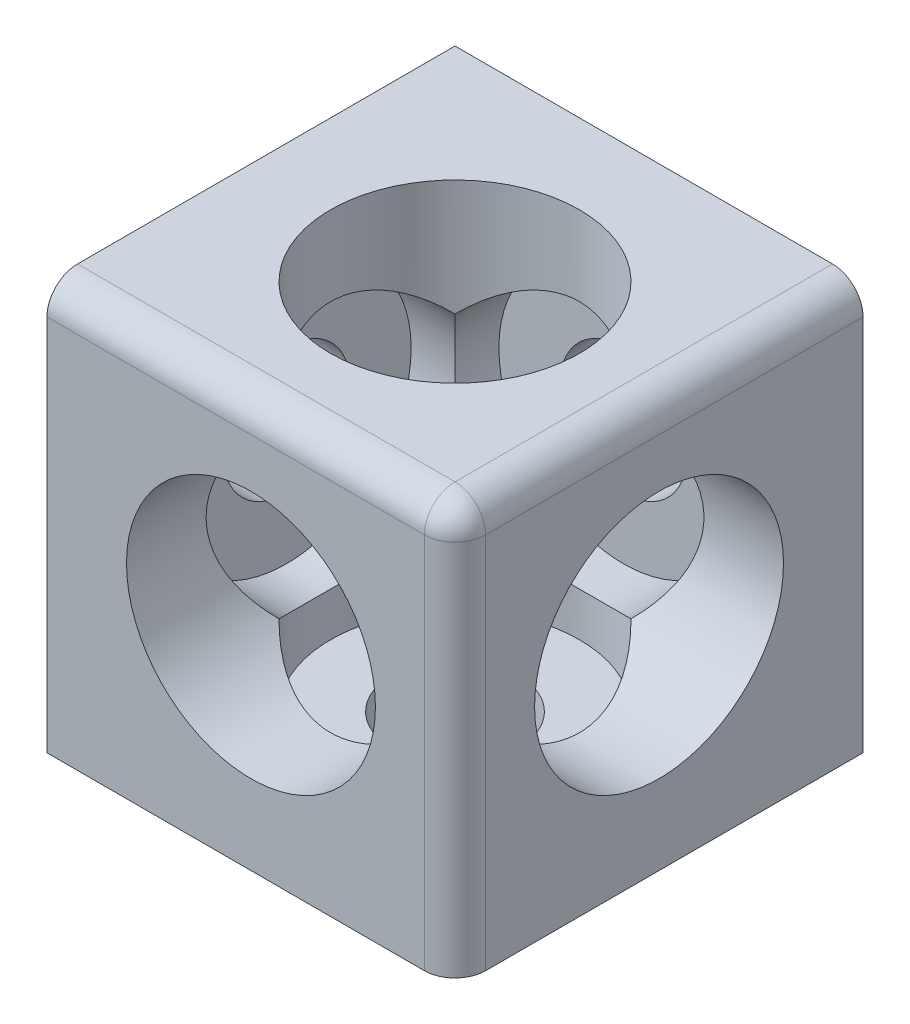
ISO-10303-21;
HEADER;
FILE_DESCRIPTION(('STEP AP214'),'2;1');
FILE_NAME('part.step','',(''),(''),'','','');
FILE_SCHEMA(('AUTOMOTIVE_DESIGN { 1 0 10303 214 1 1 1 1 }'));
ENDSEC;
DATA;
#1=APPLICATION_CONTEXT('core data for automotive mechanical design processes');
#2=APPLICATION_PROTOCOL_DEFINITION('international standard','automotive_design',2000,#1);
#3=PRODUCT_CONTEXT('',#1,'mechanical');
#4=PRODUCT('Part','Part','',(#3));
#5=PRODUCT_RELATED_PRODUCT_CATEGORY('part','',(#4));
#6=PRODUCT_DEFINITION_FORMATION('','',#4);
#7=PRODUCT_DEFINITION_CONTEXT('part definition',#1,'design');
#8=PRODUCT_DEFINITION('design','',#6,#7);
#9=PRODUCT_DEFINITION_SHAPE('','',#8);
#10=(LENGTH_UNIT() NAMED_UNIT(*) SI_UNIT(.MILLI.,.METRE.));
#11=(NAMED_UNIT(*) PLANE_ANGLE_UNIT() SI_UNIT($,.RADIAN.));
#12=(NAMED_UNIT(*) SI_UNIT($,.STERADIAN.) SOLID_ANGLE_UNIT());
#13=UNCERTAINTY_MEASURE_WITH_UNIT(LENGTH_MEASURE(1.E-05),#10,'distance_accuracy_value','');
#14=(GEOMETRIC_REPRESENTATION_CONTEXT(3) GLOBAL_UNCERTAINTY_ASSIGNED_CONTEXT((#13)) GLOBAL_UNIT_ASSIGNED_CONTEXT((#10,
#11,#12)) REPRESENTATION_CONTEXT('',''));
#15=CARTESIAN_POINT('',(0.,0.,0.));
#16=DIRECTION('',(0.,0.,1.));
#17=DIRECTION('',(1.,0.,0.));
#18=AXIS2_PLACEMENT_3D('',#15,#16,#17);
#19=CARTESIAN_POINT('',(20.,0.,1.75));
#20=DIRECTION('',(0.,0.,-1.));
#21=DIRECTION('',(-1.,0.,0.));
#22=AXIS2_PLACEMENT_3D('',#19,#20,#21);
#23=CYLINDRICAL_SURFACE('',#22,12.2);
#24=CARTESIAN_POINT('',(20.,0.,-16.5));
#25=DIRECTION('',(0.,0.,-1.));
#26=DIRECTION('',(-1.,0.,0.));
#27=AXIS2_PLACEMENT_3D('',#24,#25,#26);
#28=CIRCLE('',#27,12.2);
#29=CARTESIAN_POINT('',(7.80000000000001,0.,-16.5));
#30=VERTEX_POINT('',#29);
#31=EDGE_CURVE('E20',#30,#30,#28,.T.);
#32=ORIENTED_EDGE('',*,*,#31,.T.);
#33=EDGE_LOOP('',(#32));
#34=FACE_BOUND('',#33,.T.);
#35=CARTESIAN_POINT('',(20.,0.,0.));
#36=DIRECTION('',(0.,0.707106781186547,-0.707106781186548));
#37=DIRECTION('',(0.,-0.707106781186548,-0.707106781186547));
#38=AXIS2_PLACEMENT_3D('',#35,#36,#37);
#39=ELLIPSE('',#38,17.2534054609518,12.2);
#40=CARTESIAN_POINT('',(11.3732972695241,-8.62670273047588,-8.62670273047588));
#41=VERTEX_POINT('',#40);
#42=CARTESIAN_POINT('',(28.6267027304759,-8.62670273047588,-8.62670273047588));
#43=VERTEX_POINT('',#42);
#44=EDGE_CURVE('E107',#41,#43,#39,.F.);
#45=ORIENTED_EDGE('',*,*,#44,.T.);
#46=CARTESIAN_POINT('',(20.,0.,0.));
#47=DIRECTION('',(-0.707106781186547,0.,-0.707106781186548));
#48=DIRECTION('',(0.707106781186548,0.,-0.707106781186547));
#49=AXIS2_PLACEMENT_3D('',#46,#47,#48);
#50=ELLIPSE('',#49,17.2534054609518,12.2);
#51=CARTESIAN_POINT('',(28.6267027304759,8.62670273047588,-8.62670273047588));
#52=VERTEX_POINT('',#51);
#53=EDGE_CURVE('E89',#43,#52,#50,.F.);
#54=ORIENTED_EDGE('',*,*,#53,.T.);
#55=CARTESIAN_POINT('',(20.,0.,0.));
#56=DIRECTION('',(0.,-0.707106781186548,-0.707106781186547));
#57=DIRECTION('',(0.,0.707106781186547,-0.707106781186548));
#58=AXIS2_PLACEMENT_3D('',#55,#56,#57);
#59=ELLIPSE('',#58,17.2534054609518,12.2);
#60=CARTESIAN_POINT('',(11.3732972695241,8.62670273047588,-8.62670273047588));
#61=VERTEX_POINT('',#60);
#62=EDGE_CURVE('E100',#52,#61,#59,.F.);
#63=ORIENTED_EDGE('',*,*,#62,.T.);
#64=CARTESIAN_POINT('',(20.,0.,0.));
#65=DIRECTION('',(0.707106781186548,0.,-0.707106781186547));
#66=DIRECTION('',(-0.707106781186547,0.,-0.707106781186548));
#67=AXIS2_PLACEMENT_3D('',#64,#65,#66);
#68=ELLIPSE('',#67,17.2534054609518,12.2);
#69=EDGE_CURVE('E117',#61,#41,#68,.F.);
#70=ORIENTED_EDGE('',*,*,#69,.T.);
#71=EDGE_LOOP('',(#45,#54,#63,#70));
#72=FACE_BOUND('',#71,.T.);
#73=ADVANCED_FACE('F16',(#34,#72),#23,.F.);
#74=CARTESIAN_POINT('',(20.,0.,-16.5));
#75=DIRECTION('',(0.,0.,-1.));
#76=DIRECTION('',(-1.,0.,0.));
#77=AXIS2_PLACEMENT_3D('',#74,#75,#76);
#78=PLANE('',#77);
#79=CARTESIAN_POINT('',(20.,0.,-16.5));
#80=DIRECTION('',(0.,0.,1.));
#81=DIRECTION('',(1.,0.,0.));
#82=AXIS2_PLACEMENT_3D('',#79,#80,#81);
#83=CIRCLE('',#82,6.2);
#84=CARTESIAN_POINT('',(26.2,0.,-16.5));
#85=VERTEX_POINT('',#84);
#86=EDGE_CURVE('E96',#85,#85,#83,.F.);
#87=ORIENTED_EDGE('',*,*,#86,.T.);
#88=EDGE_LOOP('',(#87));
#89=FACE_BOUND('',#88,.T.);
#90=ORIENTED_EDGE('',*,*,#31,.F.);
#91=EDGE_LOOP('',(#90));
#92=FACE_BOUND('',#91,.T.);
#93=ADVANCED_FACE('F264',(#89,#92),#78,.F.);
#94=CARTESIAN_POINT('',(3.5,0.,0.));
#95=DIRECTION('',(-1.,0.,0.));
#96=DIRECTION('',(0.,0.,1.));
#97=AXIS2_PLACEMENT_3D('',#94,#95,#96);
#98=PLANE('',#97);
#99=CARTESIAN_POINT('',(3.5,0.,0.));
#100=DIRECTION('',(1.,0.,0.));
#101=DIRECTION('',(0.,0.,-1.));
#102=AXIS2_PLACEMENT_3D('',#99,#100,#101);
#103=CIRCLE('',#102,6.2);
#104=CARTESIAN_POINT('',(3.5,0.,-6.2));
#105=VERTEX_POINT('',#104);
#106=EDGE_CURVE('E212',#105,#105,#103,.F.);
#107=ORIENTED_EDGE('',*,*,#106,.T.);
#108=EDGE_LOOP('',(#107));
#109=FACE_BOUND('',#108,.T.);
#110=CARTESIAN_POINT('',(3.5,0.,0.));
#111=DIRECTION('',(-1.,0.,0.));
#112=DIRECTION('',(0.,0.,1.));
#113=AXIS2_PLACEMENT_3D('',#110,#111,#112);
#114=CIRCLE('',#113,12.2);
#115=CARTESIAN_POINT('',(3.5,0.,12.2));
#116=VERTEX_POINT('',#115);
#117=EDGE_CURVE('E119',#116,#116,#114,.F.);
#118=ORIENTED_EDGE('',*,*,#117,.T.);
#119=EDGE_LOOP('',(#118));
#120=FACE_BOUND('',#119,.T.);
#121=ADVANCED_FACE('F124',(#109,#120),#98,.F.);
#122=CARTESIAN_POINT('',(20.,1.75,0.));
#123=DIRECTION('',(0.,-1.,0.));
#124=DIRECTION('',(0.,0.,-1.));
#125=AXIS2_PLACEMENT_3D('',#122,#123,#124);
#126=CYLINDRICAL_SURFACE('',#125,12.2);
#127=CARTESIAN_POINT('',(20.,0.,0.));
#128=DIRECTION('',(0.,-0.707106781186547,0.707106781186548));
#129=DIRECTION('',(0.,-0.707106781186548,-0.707106781186547));
#130=AXIS2_PLACEMENT_3D('',#127,#128,#129);
#131=ELLIPSE('',#130,17.2534054609518,12.2);
#132=CARTESIAN_POINT('',(28.6267027304759,8.62670273047587,8.62670273047588));
#133=VERTEX_POINT('',#132);
#134=CARTESIAN_POINT('',(11.3732972695241,8.62670273047588,8.62670273047587));
#135=VERTEX_POINT('',#134);
#136=EDGE_CURVE('E256',#133,#135,#131,.T.);
#137=ORIENTED_EDGE('',*,*,#136,.T.);
#138=CARTESIAN_POINT('',(20.,0.,0.));
#139=DIRECTION('',(-0.707106781186547,-0.707106781186547,0.));
#140=DIRECTION('',(0.707106781186547,-0.707106781186547,0.));
#141=AXIS2_PLACEMENT_3D('',#138,#139,#140);
#142=ELLIPSE('',#141,17.2534054609518,12.2);
#143=EDGE_CURVE('E103',#135,#61,#142,.T.);
#144=ORIENTED_EDGE('',*,*,#143,.T.);
#145=ORIENTED_EDGE('',*,*,#62,.F.);
#146=CARTESIAN_POINT('',(20.,0.,0.));
#147=DIRECTION('',(0.707106781186547,-0.707106781186547,0.));
#148=DIRECTION('',(-0.707106781186547,-0.707106781186547,0.));
#149=AXIS2_PLACEMENT_3D('',#146,#147,#148);
#150=ELLIPSE('',#149,17.2534054609518,12.2);
#151=EDGE_CURVE('E84',#52,#133,#150,.T.);
#152=ORIENTED_EDGE('',*,*,#151,.T.);
#153=EDGE_LOOP('',(#137,#144,#145,#152));
#154=FACE_BOUND('',#153,.T.);
#155=CARTESIAN_POINT('',(20.,20.,0.));
#156=DIRECTION('',(0.,-1.,0.));
#157=DIRECTION('',(0.,0.,-1.));
#158=AXIS2_PLACEMENT_3D('',#155,#156,#157);
#159=CIRCLE('',#158,12.2);
#160=CARTESIAN_POINT('',(20.,20.,-12.2));
#161=VERTEX_POINT('',#160);
#162=EDGE_CURVE('E213',#161,#161,#159,.F.);
#163=ORIENTED_EDGE('',*,*,#162,.T.);
#164=EDGE_LOOP('',(#163));
#165=FACE_BOUND('',#164,.T.);
#166=ADVANCED_FACE('F101',(#154,#165),#126,.F.);
#167=CARTESIAN_POINT('',(21.75,0.,0.));
#168=DIRECTION('',(-1.,0.,0.));
#169=DIRECTION('',(0.,0.,1.));
#170=AXIS2_PLACEMENT_3D('',#167,#168,#169);
#171=CYLINDRICAL_SURFACE('',#170,12.2);
#172=ORIENTED_EDGE('',*,*,#69,.F.);
#173=ORIENTED_EDGE('',*,*,#143,.F.);
#174=CARTESIAN_POINT('',(20.,0.,0.));
#175=DIRECTION('',(-0.707106781186547,0.,-0.707106781186548));
#176=DIRECTION('',(-0.707106781186548,0.,0.707106781186547));
#177=AXIS2_PLACEMENT_3D('',#174,#175,#176);
#178=ELLIPSE('',#177,17.2534054609518,12.2);
#179=CARTESIAN_POINT('',(11.3732972695241,-8.62670273047588,8.62670273047588));
#180=VERTEX_POINT('',#179);
#181=EDGE_CURVE('E253',#135,#180,#178,.F.);
#182=ORIENTED_EDGE('',*,*,#181,.T.);
#183=CARTESIAN_POINT('',(20.,0.,0.));
#184=DIRECTION('',(-0.707106781186547,0.707106781186547,0.));
#185=DIRECTION('',(-0.707106781186547,-0.707106781186547,0.));
#186=AXIS2_PLACEMENT_3D('',#183,#184,#185);
#187=ELLIPSE('',#186,17.2534054609518,12.2);
#188=EDGE_CURVE('E111',#180,#41,#187,.F.);
#189=ORIENTED_EDGE('',*,*,#188,.T.);
#190=EDGE_LOOP('',(#172,#173,#182,#189));
#191=FACE_BOUND('',#190,.T.);
#192=ORIENTED_EDGE('',*,*,#117,.F.);
#193=EDGE_LOOP('',(#192));
#194=FACE_BOUND('',#193,.T.);
#195=ADVANCED_FACE('F126',(#191,#194),#171,.F.);
#196=CARTESIAN_POINT('',(20.,1.75,0.));
#197=DIRECTION('',(0.,-1.,0.));
#198=DIRECTION('',(0.,0.,-1.));
#199=AXIS2_PLACEMENT_3D('',#196,#197,#198);
#200=CYLINDRICAL_SURFACE('',#199,12.2);
#201=CARTESIAN_POINT('',(20.,-16.5,0.));
#202=DIRECTION('',(0.,-1.,0.));
#203=DIRECTION('',(0.,0.,-1.));
#204=AXIS2_PLACEMENT_3D('',#201,#202,#203);
#205=CIRCLE('',#204,12.2);
#206=CARTESIAN_POINT('',(20.,-16.5,-12.2));
#207=VERTEX_POINT('',#206);
#208=EDGE_CURVE('E217',#207,#207,#205,.T.);
#209=ORIENTED_EDGE('',*,*,#208,.T.);
#210=EDGE_LOOP('',(#209));
#211=FACE_BOUND('',#210,.T.);
#212=ORIENTED_EDGE('',*,*,#44,.F.);
#213=ORIENTED_EDGE('',*,*,#188,.F.);
#214=CARTESIAN_POINT('',(20.,0.,0.));
#215=DIRECTION('',(0.,-0.707106781186548,-0.707106781186547));
#216=DIRECTION('',(0.,-0.707106781186547,0.707106781186548));
#217=AXIS2_PLACEMENT_3D('',#214,#215,#216);
#218=ELLIPSE('',#217,17.2534054609518,12.2);
#219=CARTESIAN_POINT('',(28.6267027304759,-8.62670273047587,8.62670273047588));
#220=VERTEX_POINT('',#219);
#221=EDGE_CURVE('E250',#180,#220,#218,.F.);
#222=ORIENTED_EDGE('',*,*,#221,.T.);
#223=CARTESIAN_POINT('',(20.,0.,0.));
#224=DIRECTION('',(-0.707106781186547,-0.707106781186547,0.));
#225=DIRECTION('',(0.707106781186547,-0.707106781186547,0.));
#226=AXIS2_PLACEMENT_3D('',#223,#224,#225);
#227=ELLIPSE('',#226,17.2534054609518,12.2);
#228=EDGE_CURVE('E109',#220,#43,#227,.F.);
#229=ORIENTED_EDGE('',*,*,#228,.T.);
#230=EDGE_LOOP('',(#212,#213,#222,#229));
#231=FACE_BOUND('',#230,.T.);
#232=ADVANCED_FACE('F128',(#211,#231),#200,.F.);
#233=CARTESIAN_POINT('',(21.75,0.,0.));
#234=DIRECTION('',(-1.,0.,0.));
#235=DIRECTION('',(0.,0.,1.));
#236=AXIS2_PLACEMENT_3D('',#233,#234,#235);
#237=CYLINDRICAL_SURFACE('',#236,12.2);
#238=ORIENTED_EDGE('',*,*,#53,.F.);
#239=ORIENTED_EDGE('',*,*,#228,.F.);
#240=CARTESIAN_POINT('',(20.,0.,0.));
#241=DIRECTION('',(-0.707106781186548,0.,0.707106781186547));
#242=DIRECTION('',(-0.707106781186547,0.,-0.707106781186548));
#243=AXIS2_PLACEMENT_3D('',#240,#241,#242);
#244=ELLIPSE('',#243,17.2534054609518,12.2);
#245=EDGE_CURVE('E92',#220,#133,#244,.T.);
#246=ORIENTED_EDGE('',*,*,#245,.T.);
#247=ORIENTED_EDGE('',*,*,#151,.F.);
#248=EDGE_LOOP('',(#238,#239,#246,#247));
#249=FACE_BOUND('',#248,.T.);
#250=CARTESIAN_POINT('',(40.,0.,0.));
#251=DIRECTION('',(-1.,0.,0.));
#252=DIRECTION('',(0.,0.,1.));
#253=AXIS2_PLACEMENT_3D('',#250,#251,#252);
#254=CIRCLE('',#253,12.2);
#255=CARTESIAN_POINT('',(40.,0.,12.2));
#256=VERTEX_POINT('',#255);
#257=EDGE_CURVE('E187',#256,#256,#254,.F.);
#258=ORIENTED_EDGE('',*,*,#257,.T.);
#259=EDGE_LOOP('',(#258));
#260=FACE_BOUND('',#259,.T.);
#261=ADVANCED_FACE('F86',(#249,#260),#237,.F.);
#262=CARTESIAN_POINT('',(37.,17.,0.));
#263=DIRECTION('',(0.,0.,-1.));
#264=DIRECTION('',(0.,1.,0.));
#265=AXIS2_PLACEMENT_3D('',#262,#263,#264);
#266=CYLINDRICAL_SURFACE('',#265,3.);
#267=DIRECTION('',(0.,0.,1.));
#268=VECTOR('',#267,1.);
#269=CARTESIAN_POINT('',(40.,17.,0.));
#270=LINE('',#269,#268);
#271=CARTESIAN_POINT('',(40.,17.,17.));
#272=VERTEX_POINT('',#271);
#273=CARTESIAN_POINT('',(40.,17.,-20.));
#274=VERTEX_POINT('',#273);
#275=EDGE_CURVE('E188',#272,#274,#270,.F.);
#276=ORIENTED_EDGE('',*,*,#275,.T.);
#277=CARTESIAN_POINT('',(37.,17.,-20.));
#278=DIRECTION('',(0.,0.,-1.));
#279=DIRECTION('',(0.,1.,0.));
#280=AXIS2_PLACEMENT_3D('',#277,#278,#279);
#281=CIRCLE('',#280,3.);
#282=CARTESIAN_POINT('',(37.,20.,-20.));
#283=VERTEX_POINT('',#282);
#284=EDGE_CURVE('E241',#274,#283,#281,.F.);
#285=ORIENTED_EDGE('',*,*,#284,.T.);
#286=DIRECTION('',(0.,0.,-1.));
#287=VECTOR('',#286,1.);
#288=CARTESIAN_POINT('',(37.,20.,0.));
#289=LINE('',#288,#287);
#290=CARTESIAN_POINT('',(37.,20.,17.));
#291=VERTEX_POINT('',#290);
#292=EDGE_CURVE('E220',#283,#291,#289,.F.);
#293=ORIENTED_EDGE('',*,*,#292,.T.);
#294=CARTESIAN_POINT('',(37.,17.,17.));
#295=DIRECTION('',(0.,0.,1.));
#296=DIRECTION('',(1.,0.,0.));
#297=AXIS2_PLACEMENT_3D('',#294,#295,#296);
#298=CIRCLE('',#297,3.);
#299=EDGE_CURVE('E207',#272,#291,#298,.T.);
#300=ORIENTED_EDGE('',*,*,#299,.F.);
#301=EDGE_LOOP('',(#276,#285,#293,#300));
#302=FACE_BOUND('',#301,.T.);
#303=ADVANCED_FACE('F271',(#302),#266,.T.);
#304=CARTESIAN_POINT('',(20.,0.,-17.5));
#305=DIRECTION('',(0.,0.,1.));
#306=DIRECTION('',(1.,0.,0.));
#307=AXIS2_PLACEMENT_3D('',#304,#305,#306);
#308=CYLINDRICAL_SURFACE('',#307,6.2);
#309=ORIENTED_EDGE('',*,*,#86,.F.);
#310=EDGE_LOOP('',(#309));
#311=FACE_BOUND('',#310,.T.);
#312=CARTESIAN_POINT('',(20.,0.,-20.));
#313=DIRECTION('',(0.,0.,1.));
#314=DIRECTION('',(1.,0.,0.));
#315=AXIS2_PLACEMENT_3D('',#312,#313,#314);
#316=CIRCLE('',#315,6.2);
#317=CARTESIAN_POINT('',(26.2,0.,-20.));
#318=VERTEX_POINT('',#317);
#319=EDGE_CURVE('E179',#318,#318,#316,.F.);
#320=ORIENTED_EDGE('',*,*,#319,.T.);
#321=EDGE_LOOP('',(#320));
#322=FACE_BOUND('',#321,.T.);
#323=ADVANCED_FACE('F267',(#311,#322),#308,.F.);
#324=CARTESIAN_POINT('',(20.,20.,0.));
#325=DIRECTION('',(0.,-1.,0.));
#326=DIRECTION('',(0.,0.,-1.));
#327=AXIS2_PLACEMENT_3D('',#324,#325,#326);
#328=PLANE('',#327);
#329=ORIENTED_EDGE('',*,*,#162,.F.);
#330=EDGE_LOOP('',(#329));
#331=FACE_BOUND('',#330,.T.);
#332=ORIENTED_EDGE('',*,*,#292,.F.);
#333=DIRECTION('',(1.,0.,0.));
#334=VECTOR('',#333,1.);
#335=CARTESIAN_POINT('',(20.,20.,-20.));
#336=LINE('',#335,#334);
#337=CARTESIAN_POINT('',(0.,20.,-20.));
#338=VERTEX_POINT('',#337);
#339=EDGE_CURVE('E246',#283,#338,#336,.F.);
#340=ORIENTED_EDGE('',*,*,#339,.T.);
#341=DIRECTION('',(0.,0.,-1.));
#342=VECTOR('',#341,1.);
#343=CARTESIAN_POINT('',(0.,20.,0.));
#344=LINE('',#343,#342);
#345=CARTESIAN_POINT('',(0.,20.,17.));
#346=VERTEX_POINT('',#345);
#347=EDGE_CURVE('E178',#338,#346,#344,.F.);
#348=ORIENTED_EDGE('',*,*,#347,.T.);
#349=DIRECTION('',(-1.,0.,0.));
#350=VECTOR('',#349,1.);
#351=CARTESIAN_POINT('',(20.,20.,17.));
#352=LINE('',#351,#350);
#353=EDGE_CURVE('E210',#291,#346,#352,.T.);
#354=ORIENTED_EDGE('',*,*,#353,.F.);
#355=EDGE_LOOP('',(#332,#340,#348,#354));
#356=FACE_BOUND('',#355,.T.);
#357=ADVANCED_FACE('F270',(#331,#356),#328,.F.);
#358=CARTESIAN_POINT('',(2.5,0.,0.));
#359=DIRECTION('',(1.,0.,0.));
#360=DIRECTION('',(0.,0.,-1.));
#361=AXIS2_PLACEMENT_3D('',#358,#359,#360);
#362=CYLINDRICAL_SURFACE('',#361,6.2);
#363=ORIENTED_EDGE('',*,*,#106,.F.);
#364=EDGE_LOOP('',(#363));
#365=FACE_BOUND('',#364,.T.);
#366=CARTESIAN_POINT('',(0.,0.,0.));
#367=DIRECTION('',(1.,0.,0.));
#368=DIRECTION('',(0.,0.,-1.));
#369=AXIS2_PLACEMENT_3D('',#366,#367,#368);
#370=CIRCLE('',#369,6.2);
#371=CARTESIAN_POINT('',(0.,0.,-6.2));
#372=VERTEX_POINT('',#371);
#373=EDGE_CURVE('E194',#372,#372,#370,.F.);
#374=ORIENTED_EDGE('',*,*,#373,.T.);
#375=EDGE_LOOP('',(#374));
#376=FACE_BOUND('',#375,.T.);
#377=ADVANCED_FACE('F357',(#365,#376),#362,.F.);
#378=CARTESIAN_POINT('',(20.,17.,17.));
#379=DIRECTION('',(-1.,0.,0.));
#380=DIRECTION('',(0.,0.,1.));
#381=AXIS2_PLACEMENT_3D('',#378,#379,#380);
#382=CYLINDRICAL_SURFACE('',#381,3.);
#383=DIRECTION('',(1.,0.,0.));
#384=VECTOR('',#383,1.);
#385=CARTESIAN_POINT('',(20.,17.,20.));
#386=LINE('',#385,#384);
#387=CARTESIAN_POINT('',(37.,17.,20.));
#388=VERTEX_POINT('',#387);
#389=CARTESIAN_POINT('',(0.,17.,20.));
#390=VERTEX_POINT('',#389);
#391=EDGE_CURVE('E191',#388,#390,#386,.F.);
#392=ORIENTED_EDGE('',*,*,#391,.F.);
#393=CARTESIAN_POINT('',(37.,17.,17.));
#394=DIRECTION('',(1.,0.,0.));
#395=DIRECTION('',(0.,1.,0.));
#396=AXIS2_PLACEMENT_3D('',#393,#394,#395);
#397=CIRCLE('',#396,3.);
#398=EDGE_CURVE('E204',#291,#388,#397,.T.);
#399=ORIENTED_EDGE('',*,*,#398,.F.);
#400=ORIENTED_EDGE('',*,*,#353,.T.);
#401=CARTESIAN_POINT('',(0.,17.,17.));
#402=DIRECTION('',(-1.,0.,0.));
#403=DIRECTION('',(0.,0.,1.));
#404=AXIS2_PLACEMENT_3D('',#401,#402,#403);
#405=CIRCLE('',#404,3.);
#406=EDGE_CURVE('E237',#346,#390,#405,.F.);
#407=ORIENTED_EDGE('',*,*,#406,.T.);
#408=EDGE_LOOP('',(#392,#399,#400,#407));
#409=FACE_BOUND('',#408,.T.);
#410=ADVANCED_FACE('F301',(#409),#382,.T.);
#411=CARTESIAN_POINT('',(20.,0.,1.75));
#412=DIRECTION('',(0.,0.,-1.));
#413=DIRECTION('',(-1.,0.,0.));
#414=AXIS2_PLACEMENT_3D('',#411,#412,#413);
#415=CYLINDRICAL_SURFACE('',#414,12.2);
#416=CARTESIAN_POINT('',(20.,0.,20.));
#417=DIRECTION('',(0.,0.,-1.));
#418=DIRECTION('',(-1.,0.,0.));
#419=AXIS2_PLACEMENT_3D('',#416,#417,#418);
#420=CIRCLE('',#419,12.2);
#421=CARTESIAN_POINT('',(7.8,0.,20.));
#422=VERTEX_POINT('',#421);
#423=EDGE_CURVE('E201',#422,#422,#420,.T.);
#424=ORIENTED_EDGE('',*,*,#423,.F.);
#425=EDGE_LOOP('',(#424));
#426=FACE_BOUND('',#425,.T.);
#427=ORIENTED_EDGE('',*,*,#136,.F.);
#428=ORIENTED_EDGE('',*,*,#245,.F.);
#429=ORIENTED_EDGE('',*,*,#221,.F.);
#430=ORIENTED_EDGE('',*,*,#181,.F.);
#431=EDGE_LOOP('',(#427,#428,#429,#430));
#432=FACE_BOUND('',#431,.T.);
#433=ADVANCED_FACE('F329',(#426,#432),#415,.F.);
#434=CARTESIAN_POINT('',(37.,17.,17.));
#435=DIRECTION('',(1.,0.,0.));
#436=DIRECTION('',(0.,1.,0.));
#437=AXIS2_PLACEMENT_3D('',#434,#435,#436);
#438=SPHERICAL_SURFACE('',#437,3.);
#439=CARTESIAN_POINT('',(37.,17.,17.));
#440=DIRECTION('',(0.,1.,0.));
#441=DIRECTION('',(0.,0.,1.));
#442=AXIS2_PLACEMENT_3D('',#439,#440,#441);
#443=CIRCLE('',#442,3.);
#444=EDGE_CURVE('E197',#272,#388,#443,.F.);
#445=ORIENTED_EDGE('',*,*,#444,.F.);
#446=ORIENTED_EDGE('',*,*,#299,.T.);
#447=ORIENTED_EDGE('',*,*,#398,.T.);
#448=EDGE_LOOP('',(#445,#446,#447));
#449=FACE_BOUND('',#448,.T.);
#450=ADVANCED_FACE('F324',(#449),#438,.T.);
#451=CARTESIAN_POINT('',(20.,-16.5,0.));
#452=DIRECTION('',(0.,-1.,0.));
#453=DIRECTION('',(0.,0.,-1.));
#454=AXIS2_PLACEMENT_3D('',#451,#452,#453);
#455=PLANE('',#454);
#456=CARTESIAN_POINT('',(20.,-16.5,0.));
#457=DIRECTION('',(0.,1.,0.));
#458=DIRECTION('',(0.,0.,1.));
#459=AXIS2_PLACEMENT_3D('',#456,#457,#458);
#460=CIRCLE('',#459,6.2);
#461=CARTESIAN_POINT('',(20.,-16.5,6.2));
#462=VERTEX_POINT('',#461);
#463=EDGE_CURVE('E230',#462,#462,#460,.F.);
#464=ORIENTED_EDGE('',*,*,#463,.T.);
#465=EDGE_LOOP('',(#464));
#466=FACE_BOUND('',#465,.T.);
#467=ORIENTED_EDGE('',*,*,#208,.F.);
#468=EDGE_LOOP('',(#467));
#469=FACE_BOUND('',#468,.T.);
#470=ADVANCED_FACE('F328',(#466,#469),#455,.F.);
#471=CARTESIAN_POINT('',(40.,0.,0.));
#472=DIRECTION('',(-1.,0.,0.));
#473=DIRECTION('',(0.,0.,1.));
#474=AXIS2_PLACEMENT_3D('',#471,#472,#473);
#475=PLANE('',#474);
#476=ORIENTED_EDGE('',*,*,#257,.F.);
#477=EDGE_LOOP('',(#476));
#478=FACE_BOUND('',#477,.T.);
#479=DIRECTION('',(0.,0.,1.));
#480=VECTOR('',#479,1.);
#481=CARTESIAN_POINT('',(40.,-20.,0.));
#482=LINE('',#481,#480);
#483=CARTESIAN_POINT('',(40.,-20.,17.));
#484=VERTEX_POINT('',#483);
#485=CARTESIAN_POINT('',(40.,-20.,-20.));
#486=VERTEX_POINT('',#485);
#487=EDGE_CURVE('E169',#484,#486,#482,.F.);
#488=ORIENTED_EDGE('',*,*,#487,.T.);
#489=DIRECTION('',(0.,1.,0.));
#490=VECTOR('',#489,1.);
#491=CARTESIAN_POINT('',(40.,0.,-20.));
#492=LINE('',#491,#490);
#493=EDGE_CURVE('E243',#486,#274,#492,.T.);
#494=ORIENTED_EDGE('',*,*,#493,.T.);
#495=ORIENTED_EDGE('',*,*,#275,.F.);
#496=DIRECTION('',(0.,1.,0.));
#497=VECTOR('',#496,1.);
#498=CARTESIAN_POINT('',(40.,0.,17.));
#499=LINE('',#498,#497);
#500=EDGE_CURVE('E184',#484,#272,#499,.T.);
#501=ORIENTED_EDGE('',*,*,#500,.F.);
#502=EDGE_LOOP('',(#488,#494,#495,#501));
#503=FACE_BOUND('',#502,.T.);
#504=ADVANCED_FACE('F278',(#478,#503),#475,.F.);
#505=CARTESIAN_POINT('',(20.,0.,-20.));
#506=DIRECTION('',(0.,0.,1.));
#507=DIRECTION('',(1.,0.,0.));
#508=AXIS2_PLACEMENT_3D('',#505,#506,#507);
#509=PLANE('',#508);
#510=ORIENTED_EDGE('',*,*,#319,.F.);
#511=EDGE_LOOP('',(#510));
#512=FACE_BOUND('',#511,.T.);
#513=ORIENTED_EDGE('',*,*,#493,.F.);
#514=DIRECTION('',(1.,0.,0.));
#515=VECTOR('',#514,1.);
#516=CARTESIAN_POINT('',(20.,-20.,-20.));
#517=LINE('',#516,#515);
#518=CARTESIAN_POINT('',(0.,-20.,-20.));
#519=VERTEX_POINT('',#518);
#520=EDGE_CURVE('E167',#486,#519,#517,.F.);
#521=ORIENTED_EDGE('',*,*,#520,.T.);
#522=DIRECTION('',(0.,1.,0.));
#523=VECTOR('',#522,1.);
#524=CARTESIAN_POINT('',(0.,0.,-20.));
#525=LINE('',#524,#523);
#526=EDGE_CURVE('E166',#519,#338,#525,.T.);
#527=ORIENTED_EDGE('',*,*,#526,.T.);
#528=ORIENTED_EDGE('',*,*,#339,.F.);
#529=ORIENTED_EDGE('',*,*,#284,.F.);
#530=EDGE_LOOP('',(#513,#521,#527,#528,#529));
#531=FACE_BOUND('',#530,.T.);
#532=ADVANCED_FACE('F275',(#512,#531),#509,.F.);
#533=CARTESIAN_POINT('',(0.,0.,0.));
#534=DIRECTION('',(1.,0.,0.));
#535=DIRECTION('',(0.,0.,-1.));
#536=AXIS2_PLACEMENT_3D('',#533,#534,#535);
#537=PLANE('',#536);
#538=ORIENTED_EDGE('',*,*,#373,.F.);
#539=EDGE_LOOP('',(#538));
#540=FACE_BOUND('',#539,.T.);
#541=ORIENTED_EDGE('',*,*,#347,.F.);
#542=ORIENTED_EDGE('',*,*,#526,.F.);
#543=DIRECTION('',(0.,0.,1.));
#544=VECTOR('',#543,1.);
#545=CARTESIAN_POINT('',(0.,-20.,0.));
#546=LINE('',#545,#544);
#547=CARTESIAN_POINT('',(0.,-20.,20.));
#548=VERTEX_POINT('',#547);
#549=EDGE_CURVE('E153',#519,#548,#546,.T.);
#550=ORIENTED_EDGE('',*,*,#549,.T.);
#551=DIRECTION('',(0.,1.,0.));
#552=VECTOR('',#551,1.);
#553=CARTESIAN_POINT('',(0.,0.,20.));
#554=LINE('',#553,#552);
#555=EDGE_CURVE('E164',#390,#548,#554,.F.);
#556=ORIENTED_EDGE('',*,*,#555,.F.);
#557=ORIENTED_EDGE('',*,*,#406,.F.);
#558=EDGE_LOOP('',(#541,#542,#550,#556,#557));
#559=FACE_BOUND('',#558,.T.);
#560=ADVANCED_FACE('F162',(#540,#559),#537,.F.);
#561=CARTESIAN_POINT('',(20.,0.,20.));
#562=DIRECTION('',(0.,0.,1.));
#563=DIRECTION('',(1.,0.,0.));
#564=AXIS2_PLACEMENT_3D('',#561,#562,#563);
#565=PLANE('',#564);
#566=ORIENTED_EDGE('',*,*,#423,.T.);
#567=EDGE_LOOP('',(#566));
#568=FACE_BOUND('',#567,.T.);
#569=DIRECTION('',(1.,0.,0.));
#570=VECTOR('',#569,1.);
#571=CARTESIAN_POINT('',(20.,-20.,20.));
#572=LINE('',#571,#570);
#573=CARTESIAN_POINT('',(37.,-20.,20.));
#574=VERTEX_POINT('',#573);
#575=EDGE_CURVE('E26',#548,#574,#572,.T.);
#576=ORIENTED_EDGE('',*,*,#575,.T.);
#577=DIRECTION('',(0.,1.,0.));
#578=VECTOR('',#577,1.);
#579=CARTESIAN_POINT('',(37.,0.,20.));
#580=LINE('',#579,#578);
#581=EDGE_CURVE('E200',#388,#574,#580,.F.);
#582=ORIENTED_EDGE('',*,*,#581,.F.);
#583=ORIENTED_EDGE('',*,*,#391,.T.);
#584=ORIENTED_EDGE('',*,*,#555,.T.);
#585=EDGE_LOOP('',(#576,#582,#583,#584));
#586=FACE_BOUND('',#585,.T.);
#587=ADVANCED_FACE('F297',(#568,#586),#565,.T.);
#588=CARTESIAN_POINT('',(37.,0.,17.));
#589=DIRECTION('',(0.,1.,0.));
#590=DIRECTION('',(0.,0.,1.));
#591=AXIS2_PLACEMENT_3D('',#588,#589,#590);
#592=CYLINDRICAL_SURFACE('',#591,3.);
#593=ORIENTED_EDGE('',*,*,#581,.T.);
#594=CARTESIAN_POINT('',(37.,-20.,17.));
#595=DIRECTION('',(0.,1.,0.));
#596=DIRECTION('',(0.,0.,1.));
#597=AXIS2_PLACEMENT_3D('',#594,#595,#596);
#598=CIRCLE('',#597,3.);
#599=EDGE_CURVE('E35',#574,#484,#598,.T.);
#600=ORIENTED_EDGE('',*,*,#599,.T.);
#601=ORIENTED_EDGE('',*,*,#500,.T.);
#602=ORIENTED_EDGE('',*,*,#444,.T.);
#603=EDGE_LOOP('',(#593,#600,#601,#602));
#604=FACE_BOUND('',#603,.T.);
#605=ADVANCED_FACE('F146',(#604),#592,.T.);
#606=CARTESIAN_POINT('',(20.,-17.5,0.));
#607=DIRECTION('',(0.,1.,0.));
#608=DIRECTION('',(0.,0.,1.));
#609=AXIS2_PLACEMENT_3D('',#606,#607,#608);
#610=CYLINDRICAL_SURFACE('',#609,6.2);
#611=ORIENTED_EDGE('',*,*,#463,.F.);
#612=EDGE_LOOP('',(#611));
#613=FACE_BOUND('',#612,.T.);
#614=CARTESIAN_POINT('',(20.,-20.,0.));
#615=DIRECTION('',(0.,1.,0.));
#616=DIRECTION('',(0.,0.,1.));
#617=AXIS2_PLACEMENT_3D('',#614,#615,#616);
#618=CIRCLE('',#617,6.2);
#619=CARTESIAN_POINT('',(20.,-20.,6.2));
#620=VERTEX_POINT('',#619);
#621=EDGE_CURVE('E11',#620,#620,#618,.F.);
#622=ORIENTED_EDGE('',*,*,#621,.T.);
#623=EDGE_LOOP('',(#622));
#624=FACE_BOUND('',#623,.T.);
#625=ADVANCED_FACE('F141',(#613,#624),#610,.F.);
#626=CARTESIAN_POINT('',(20.,-20.,0.));
#627=DIRECTION('',(0.,1.,0.));
#628=DIRECTION('',(0.,0.,1.));
#629=AXIS2_PLACEMENT_3D('',#626,#627,#628);
#630=PLANE('',#629);
#631=ORIENTED_EDGE('',*,*,#621,.F.);
#632=EDGE_LOOP('',(#631));
#633=FACE_BOUND('',#632,.T.);
#634=ORIENTED_EDGE('',*,*,#575,.F.);
#635=ORIENTED_EDGE('',*,*,#549,.F.);
#636=ORIENTED_EDGE('',*,*,#520,.F.);
#637=ORIENTED_EDGE('',*,*,#487,.F.);
#638=ORIENTED_EDGE('',*,*,#599,.F.);
#639=EDGE_LOOP('',(#634,#635,#636,#637,#638));
#640=FACE_BOUND('',#639,.T.);
#641=ADVANCED_FACE('F18',(#633,#640),#630,.F.);
#642=CLOSED_SHELL('',(#73,#93,#121,#166,#195,#232,#261,#303,#323,#357,#377,#410,#433,#450,#470,
#504,#532,#560,#587,#605,#625,#641));
#643=MANIFOLD_SOLID_BREP('B1',#642);
#644=ADVANCED_BREP_SHAPE_REPRESENTATION('',(#18,#643),#14);
#645=SHAPE_DEFINITION_REPRESENTATION(#9,#644);
ENDSEC;
END-ISO-10303-21;
